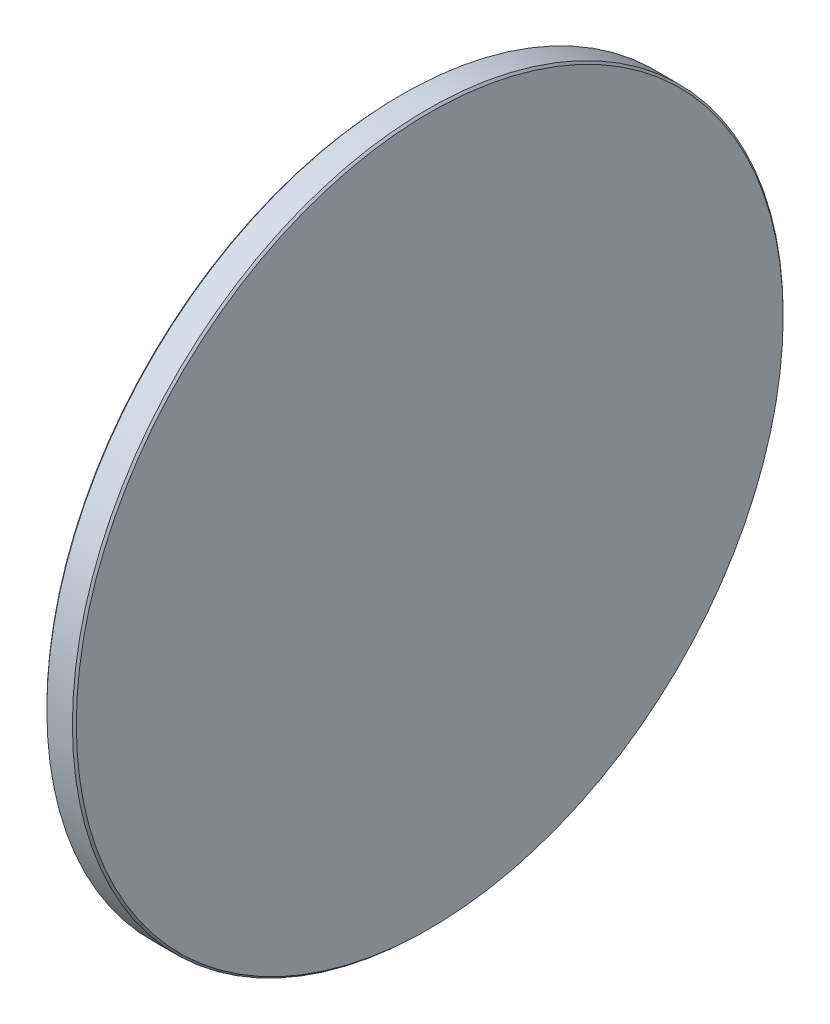
ISO-10303-21;
HEADER;
FILE_DESCRIPTION(('STEP AP214'),'2;1');
FILE_NAME('part.step','',(''),(''),'','','');
FILE_SCHEMA(('AUTOMOTIVE_DESIGN { 1 0 10303 214 1 1 1 1 }'));
ENDSEC;
DATA;
#1=APPLICATION_CONTEXT('core data for automotive mechanical design processes');
#2=APPLICATION_PROTOCOL_DEFINITION('international standard','automotive_design',2000,#1);
#3=PRODUCT_CONTEXT('',#1,'mechanical');
#4=PRODUCT('Part','Part','',(#3));
#5=PRODUCT_RELATED_PRODUCT_CATEGORY('part','',(#4));
#6=PRODUCT_DEFINITION_FORMATION('','',#4);
#7=PRODUCT_DEFINITION_CONTEXT('part definition',#1,'design');
#8=PRODUCT_DEFINITION('design','',#6,#7);
#9=PRODUCT_DEFINITION_SHAPE('','',#8);
#10=(LENGTH_UNIT() NAMED_UNIT(*) SI_UNIT(.MILLI.,.METRE.));
#11=(NAMED_UNIT(*) PLANE_ANGLE_UNIT() SI_UNIT($,.RADIAN.));
#12=(NAMED_UNIT(*) SI_UNIT($,.STERADIAN.) SOLID_ANGLE_UNIT());
#13=UNCERTAINTY_MEASURE_WITH_UNIT(LENGTH_MEASURE(1.E-05),#10,'distance_accuracy_value','');
#14=(GEOMETRIC_REPRESENTATION_CONTEXT(3) GLOBAL_UNCERTAINTY_ASSIGNED_CONTEXT((#13)) GLOBAL_UNIT_ASSIGNED_CONTEXT((#10,
#11,#12)) REPRESENTATION_CONTEXT('',''));
#15=CARTESIAN_POINT('',(0.,0.,0.));
#16=DIRECTION('',(0.,0.,1.));
#17=DIRECTION('',(1.,0.,0.));
#18=AXIS2_PLACEMENT_3D('',#15,#16,#17);
#19=CARTESIAN_POINT('',(-1.055,0.,0.));
#20=DIRECTION('',(1.,0.,0.));
#21=DIRECTION('',(0.,0.,-1.));
#22=AXIS2_PLACEMENT_3D('',#19,#20,#21);
#23=PLANE('',#22);
#24=CARTESIAN_POINT('',(-1.055,0.,0.));
#25=DIRECTION('',(-1.,0.,0.));
#26=DIRECTION('',(0.,0.,1.));
#27=AXIS2_PLACEMENT_3D('',#24,#25,#26);
#28=CIRCLE('',#27,25.2585786437627);
#29=CARTESIAN_POINT('',(-1.055,0.,25.2585786437627));
#30=VERTEX_POINT('',#29);
#31=EDGE_CURVE('E10',#30,#30,#28,.T.);
#32=ORIENTED_EDGE('',*,*,#31,.T.);
#33=EDGE_LOOP('',(#32));
#34=FACE_BOUND('',#33,.T.);
#35=ADVANCED_FACE('F14',(#34),#23,.F.);
#36=CARTESIAN_POINT('',(-0.913578643762691,0.,0.));
#37=DIRECTION('',(1.,0.,0.));
#38=DIRECTION('',(0.,0.,-1.));
#39=AXIS2_PLACEMENT_3D('',#36,#37,#38);
#40=CONICAL_SURFACE('',#39,25.4,0.785398163397451);
#41=ORIENTED_EDGE('',*,*,#31,.F.);
#42=EDGE_LOOP('',(#41));
#43=FACE_BOUND('',#42,.T.);
#44=CARTESIAN_POINT('',(-0.913578643762691,0.,0.));
#45=DIRECTION('',(-1.,0.,0.));
#46=DIRECTION('',(0.,0.,1.));
#47=AXIS2_PLACEMENT_3D('',#44,#45,#46);
#48=CIRCLE('',#47,25.4);
#49=CARTESIAN_POINT('',(-0.913578643762691,0.,25.4));
#50=VERTEX_POINT('',#49);
#51=EDGE_CURVE('E20',#50,#50,#48,.T.);
#52=ORIENTED_EDGE('',*,*,#51,.T.);
#53=EDGE_LOOP('',(#52));
#54=FACE_BOUND('',#53,.T.);
#55=ADVANCED_FACE('F47',(#43,#54),#40,.T.);
#56=CARTESIAN_POINT('',(-1.055,0.,0.));
#57=DIRECTION('',(-1.,0.,0.));
#58=DIRECTION('',(0.,0.,1.));
#59=AXIS2_PLACEMENT_3D('',#56,#57,#58);
#60=CYLINDRICAL_SURFACE('',#59,25.4);
#61=ORIENTED_EDGE('',*,*,#51,.F.);
#62=EDGE_LOOP('',(#61));
#63=FACE_BOUND('',#62,.T.);
#64=CARTESIAN_POINT('',(0.913578643762692,0.,0.));
#65=DIRECTION('',(-1.,0.,0.));
#66=DIRECTION('',(0.,0.,1.));
#67=AXIS2_PLACEMENT_3D('',#64,#65,#66);
#68=CIRCLE('',#67,25.4);
#69=CARTESIAN_POINT('',(0.913578643762692,0.,25.4));
#70=VERTEX_POINT('',#69);
#71=EDGE_CURVE('E24',#70,#70,#68,.T.);
#72=ORIENTED_EDGE('',*,*,#71,.T.);
#73=EDGE_LOOP('',(#72));
#74=FACE_BOUND('',#73,.T.);
#75=ADVANCED_FACE('F43',(#63,#74),#60,.T.);
#76=CARTESIAN_POINT('',(1.055,0.,0.));
#77=DIRECTION('',(-1.,0.,0.));
#78=DIRECTION('',(0.,0.,1.));
#79=AXIS2_PLACEMENT_3D('',#76,#77,#78);
#80=CONICAL_SURFACE('',#79,25.2585786437627,0.78539816339745);
#81=ORIENTED_EDGE('',*,*,#71,.F.);
#82=EDGE_LOOP('',(#81));
#83=FACE_BOUND('',#82,.T.);
#84=CARTESIAN_POINT('',(1.055,0.,0.));
#85=DIRECTION('',(-1.,0.,0.));
#86=DIRECTION('',(0.,0.,1.));
#87=AXIS2_PLACEMENT_3D('',#84,#85,#86);
#88=CIRCLE('',#87,25.2585786437627);
#89=CARTESIAN_POINT('',(1.055,0.,25.2585786437627));
#90=VERTEX_POINT('',#89);
#91=EDGE_CURVE('E28',#90,#90,#88,.T.);
#92=ORIENTED_EDGE('',*,*,#91,.T.);
#93=EDGE_LOOP('',(#92));
#94=FACE_BOUND('',#93,.T.);
#95=ADVANCED_FACE('F34',(#83,#94),#80,.T.);
#96=CARTESIAN_POINT('',(1.055,0.,0.));
#97=DIRECTION('',(-1.,0.,0.));
#98=DIRECTION('',(0.,0.,1.));
#99=AXIS2_PLACEMENT_3D('',#96,#97,#98);
#100=PLANE('',#99);
#101=ORIENTED_EDGE('',*,*,#91,.F.);
#102=EDGE_LOOP('',(#101));
#103=FACE_BOUND('',#102,.T.);
#104=ADVANCED_FACE('F36',(#103),#100,.F.);
#105=CLOSED_SHELL('',(#35,#55,#75,#95,#104));
#106=MANIFOLD_SOLID_BREP('B1',#105);
#107=ADVANCED_BREP_SHAPE_REPRESENTATION('',(#18,#106),#14);
#108=SHAPE_DEFINITION_REPRESENTATION(#9,#107);
ENDSEC;
END-ISO-10303-21;
